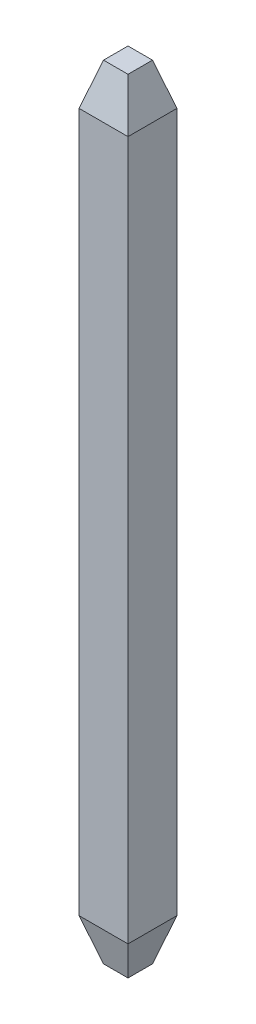
ISO-10303-21;
HEADER;
FILE_DESCRIPTION(('STEP AP214'),'2;1');
FILE_NAME('part.step','',(''),(''),'','','');
FILE_SCHEMA(('AUTOMOTIVE_DESIGN { 1 0 10303 214 1 1 1 1 }'));
ENDSEC;
DATA;
#1=APPLICATION_CONTEXT('core data for automotive mechanical design processes');
#2=APPLICATION_PROTOCOL_DEFINITION('international standard','automotive_design',2000,#1);
#3=PRODUCT_CONTEXT('',#1,'mechanical');
#4=PRODUCT('Part','Part','',(#3));
#5=PRODUCT_RELATED_PRODUCT_CATEGORY('part','',(#4));
#6=PRODUCT_DEFINITION_FORMATION('','',#4);
#7=PRODUCT_DEFINITION_CONTEXT('part definition',#1,'design');
#8=PRODUCT_DEFINITION('design','',#6,#7);
#9=PRODUCT_DEFINITION_SHAPE('','',#8);
#10=(LENGTH_UNIT() NAMED_UNIT(*) SI_UNIT(.MILLI.,.METRE.));
#11=(NAMED_UNIT(*) PLANE_ANGLE_UNIT() SI_UNIT($,.RADIAN.));
#12=(NAMED_UNIT(*) SI_UNIT($,.STERADIAN.) SOLID_ANGLE_UNIT());
#13=UNCERTAINTY_MEASURE_WITH_UNIT(LENGTH_MEASURE(1.E-05),#10,'distance_accuracy_value','');
#14=(GEOMETRIC_REPRESENTATION_CONTEXT(3) GLOBAL_UNCERTAINTY_ASSIGNED_CONTEXT((#13)) GLOBAL_UNIT_ASSIGNED_CONTEXT((#10,
#11,#12)) REPRESENTATION_CONTEXT('',''));
#15=CARTESIAN_POINT('',(0.,0.,0.));
#16=DIRECTION('',(0.,0.,1.));
#17=DIRECTION('',(1.,0.,0.));
#18=AXIS2_PLACEMENT_3D('',#15,#16,#17);
#19=CARTESIAN_POINT('',(13.8100000000129,-5.53543505344786,-16.6589999999763));
#20=DIRECTION('',(-1.,0.,0.));
#21=DIRECTION('',(0.,0.,1.));
#22=AXIS2_PLACEMENT_3D('',#19,#20,#21);
#23=PLANE('',#22);
#24=DIRECTION('',(0.,1.,0.));
#25=VECTOR('',#24,1.);
#26=CARTESIAN_POINT('',(13.8100000000129,-10.1039999999831,-17.2999999999763));
#27=LINE('',#26,#25);
#28=CARTESIAN_POINT('',(13.8100000000129,-10.1039999999831,-17.2999999999763));
#29=VERTEX_POINT('',#28);
#30=CARTESIAN_POINT('',(13.8100000000129,-0.965870106912631,-17.2999999999763));
#31=VERTEX_POINT('',#30);
#32=EDGE_CURVE('E137',#29,#31,#27,.T.);
#33=ORIENTED_EDGE('',*,*,#32,.F.);
#34=DIRECTION('',(0.,0.,-1.));
#35=VECTOR('',#34,1.);
#36=CARTESIAN_POINT('',(13.8100000000129,-10.1039999999831,-16.6599999999763));
#37=LINE('',#36,#35);
#38=CARTESIAN_POINT('',(13.8100000000129,-10.1039999999831,-16.6599999999763));
#39=VERTEX_POINT('',#38);
#40=EDGE_CURVE('E41',#39,#29,#37,.T.);
#41=ORIENTED_EDGE('',*,*,#40,.F.);
#42=DIRECTION('',(0.,1.,0.));
#43=VECTOR('',#42,1.);
#44=CARTESIAN_POINT('',(13.8100000000129,-10.1039999999831,-16.6599999999763));
#45=LINE('',#44,#43);
#46=CARTESIAN_POINT('',(13.8100000000129,-0.965870106912631,-16.6599999999763));
#47=VERTEX_POINT('',#46);
#48=EDGE_CURVE('E11',#39,#47,#45,.T.);
#49=ORIENTED_EDGE('',*,*,#48,.T.);
#50=DIRECTION('',(0.,0.,-1.));
#51=VECTOR('',#50,1.);
#52=CARTESIAN_POINT('',(13.8100000000129,-0.965870106912629,-16.6599999999763));
#53=LINE('',#52,#51);
#54=EDGE_CURVE('E28',#47,#31,#53,.T.);
#55=ORIENTED_EDGE('',*,*,#54,.T.);
#56=EDGE_LOOP('',(#33,#41,#49,#55));
#57=FACE_BOUND('',#56,.T.);
#58=ADVANCED_FACE('F17',(#57),#23,.T.);
#59=CARTESIAN_POINT('',(14.4510000000129,-5.53443505344787,-17.2999999999763));
#60=DIRECTION('',(0.,0.,-1.));
#61=DIRECTION('',(0.,-1.,0.));
#62=AXIS2_PLACEMENT_3D('',#59,#60,#61);
#63=PLANE('',#62);
#64=DIRECTION('',(0.,1.,0.));
#65=VECTOR('',#64,1.);
#66=CARTESIAN_POINT('',(14.4500000000129,-10.1039999999831,-17.2999999999763));
#67=LINE('',#66,#65);
#68=CARTESIAN_POINT('',(14.4500000000129,-10.1039999999831,-17.2999999999763));
#69=VERTEX_POINT('',#68);
#70=CARTESIAN_POINT('',(14.4500000000129,-0.965870106912631,-17.2999999999763));
#71=VERTEX_POINT('',#70);
#72=EDGE_CURVE('E143',#69,#71,#67,.T.);
#73=ORIENTED_EDGE('',*,*,#72,.F.);
#74=DIRECTION('',(1.,0.,0.));
#75=VECTOR('',#74,1.);
#76=CARTESIAN_POINT('',(13.8100000000129,-10.1039999999831,-17.2999999999763));
#77=LINE('',#76,#75);
#78=EDGE_CURVE('E161',#29,#69,#77,.T.);
#79=ORIENTED_EDGE('',*,*,#78,.F.);
#80=ORIENTED_EDGE('',*,*,#32,.T.);
#81=DIRECTION('',(1.,0.,0.));
#82=VECTOR('',#81,1.);
#83=CARTESIAN_POINT('',(13.8100000000129,-0.965870106912629,-17.2999999999763));
#84=LINE('',#83,#82);
#85=EDGE_CURVE('E139',#31,#71,#84,.T.);
#86=ORIENTED_EDGE('',*,*,#85,.T.);
#87=EDGE_LOOP('',(#73,#79,#80,#86));
#88=FACE_BOUND('',#87,.T.);
#89=ADVANCED_FACE('F321',(#88),#63,.T.);
#90=CARTESIAN_POINT('',(14.4500000000129,-11.0738701069126,-16.9799999999763));
#91=DIRECTION('',(1.,0.,0.));
#92=DIRECTION('',(0.,1.,0.));
#93=AXIS2_PLACEMENT_3D('',#90,#91,#92);
#94=PLANE('',#93);
#95=DIRECTION('',(0.,1.,0.));
#96=VECTOR('',#95,1.);
#97=CARTESIAN_POINT('',(14.4500000000129,-10.1039999999831,-16.6599999999763));
#98=LINE('',#97,#96);
#99=CARTESIAN_POINT('',(14.4500000000129,-10.1039999999831,-16.6599999999763));
#100=VERTEX_POINT('',#99);
#101=CARTESIAN_POINT('',(14.4500000000129,-0.965870106912631,-16.6599999999763));
#102=VERTEX_POINT('',#101);
#103=EDGE_CURVE('E157',#100,#102,#98,.T.);
#104=ORIENTED_EDGE('',*,*,#103,.F.);
#105=DIRECTION('',(0.,0.,1.));
#106=VECTOR('',#105,1.);
#107=CARTESIAN_POINT('',(14.4500000000129,-10.1039999999831,-17.2999999999763));
#108=LINE('',#107,#106);
#109=EDGE_CURVE('E166',#69,#100,#108,.T.);
#110=ORIENTED_EDGE('',*,*,#109,.F.);
#111=ORIENTED_EDGE('',*,*,#72,.T.);
#112=DIRECTION('',(0.,0.,1.));
#113=VECTOR('',#112,1.);
#114=CARTESIAN_POINT('',(14.4500000000129,-0.965870106912629,-17.2999999999763));
#115=LINE('',#114,#113);
#116=EDGE_CURVE('E147',#71,#102,#115,.T.);
#117=ORIENTED_EDGE('',*,*,#116,.T.);
#118=EDGE_LOOP('',(#104,#110,#111,#117));
#119=FACE_BOUND('',#118,.T.);
#120=ADVANCED_FACE('F312',(#119),#94,.T.);
#121=CARTESIAN_POINT('',(14.4500000000129,-0.965870106912629,-16.9799999999763));
#122=DIRECTION('',(0.95964490090097,0.281214622974639,0.));
#123=DIRECTION('',(0.,0.,-1.));
#124=AXIS2_PLACEMENT_3D('',#121,#122,#123);
#125=PLANE('',#124);
#126=DIRECTION('',(-0.270714017147724,0.923811583516618,0.270714017147727));
#127=VECTOR('',#126,1.);
#128=CARTESIAN_POINT('',(14.4500000000129,-0.965870106912629,-17.2999999999763));
#129=LINE('',#128,#127);
#130=CARTESIAN_POINT('',(14.2900000000129,-0.419870106912631,-17.1399999999763));
#131=VERTEX_POINT('',#130);
#132=EDGE_CURVE('E148',#71,#131,#129,.T.);
#133=ORIENTED_EDGE('',*,*,#132,.T.);
#134=DIRECTION('',(0.,0.,1.));
#135=VECTOR('',#134,1.);
#136=CARTESIAN_POINT('',(14.2900000000129,-0.419870106912629,-17.1399999999763));
#137=LINE('',#136,#135);
#138=CARTESIAN_POINT('',(14.2900000000129,-0.419870106912631,-16.8199999999763));
#139=VERTEX_POINT('',#138);
#140=EDGE_CURVE('E152',#131,#139,#137,.T.);
#141=ORIENTED_EDGE('',*,*,#140,.T.);
#142=DIRECTION('',(-0.270714017147724,0.923811583516618,-0.270714017147727));
#143=VECTOR('',#142,1.);
#144=CARTESIAN_POINT('',(14.4500000000129,-0.965870106912629,-16.6599999999763));
#145=LINE('',#144,#143);
#146=EDGE_CURVE('E165',#102,#139,#145,.T.);
#147=ORIENTED_EDGE('',*,*,#146,.F.);
#148=ORIENTED_EDGE('',*,*,#116,.F.);
#149=EDGE_LOOP('',(#133,#141,#147,#148));
#150=FACE_BOUND('',#149,.T.);
#151=ADVANCED_FACE('F309',(#150),#125,.T.);
#152=CARTESIAN_POINT('',(14.1300000000129,-0.965870106912629,-16.6599999999763));
#153=DIRECTION('',(0.,0.281214622974643,0.959644900900968));
#154=DIRECTION('',(1.,0.,0.));
#155=AXIS2_PLACEMENT_3D('',#152,#153,#154);
#156=PLANE('',#155);
#157=ORIENTED_EDGE('',*,*,#146,.T.);
#158=DIRECTION('',(-1.,0.,0.));
#159=VECTOR('',#158,1.);
#160=CARTESIAN_POINT('',(14.2900000000129,-0.419870106912629,-16.8199999999763));
#161=LINE('',#160,#159);
#162=CARTESIAN_POINT('',(13.9700000000129,-0.419870106912631,-16.8199999999763));
#163=VERTEX_POINT('',#162);
#164=EDGE_CURVE('E162',#139,#163,#161,.T.);
#165=ORIENTED_EDGE('',*,*,#164,.T.);
#166=DIRECTION('',(0.270714017147727,0.923811583516618,-0.270714017147727));
#167=VECTOR('',#166,1.);
#168=CARTESIAN_POINT('',(13.8100000000129,-0.965870106912629,-16.6599999999763));
#169=LINE('',#168,#167);
#170=EDGE_CURVE('E156',#47,#163,#169,.T.);
#171=ORIENTED_EDGE('',*,*,#170,.F.);
#172=DIRECTION('',(-1.,0.,0.));
#173=VECTOR('',#172,1.);
#174=CARTESIAN_POINT('',(14.4500000000129,-0.965870106912629,-16.6599999999763));
#175=LINE('',#174,#173);
#176=EDGE_CURVE('E174',#102,#47,#175,.T.);
#177=ORIENTED_EDGE('',*,*,#176,.F.);
#178=EDGE_LOOP('',(#157,#165,#171,#177));
#179=FACE_BOUND('',#178,.T.);
#180=ADVANCED_FACE('F314',(#179),#156,.T.);
#181=CARTESIAN_POINT('',(14.1300000000129,-0.419870106912629,-17.1409999999763));
#182=DIRECTION('',(0.,1.,0.));
#183=DIRECTION('',(1.,0.,0.));
#184=AXIS2_PLACEMENT_3D('',#181,#182,#183);
#185=PLANE('',#184);
#186=DIRECTION('',(1.,0.,0.));
#187=VECTOR('',#186,1.);
#188=CARTESIAN_POINT('',(13.9700000000129,-0.419870106912629,-17.1399999999763));
#189=LINE('',#188,#187);
#190=CARTESIAN_POINT('',(13.9700000000129,-0.419870106912631,-17.1399999999763));
#191=VERTEX_POINT('',#190);
#192=EDGE_CURVE('E133',#191,#131,#189,.T.);
#193=ORIENTED_EDGE('',*,*,#192,.F.);
#194=DIRECTION('',(0.,0.,-1.));
#195=VECTOR('',#194,1.);
#196=CARTESIAN_POINT('',(13.9700000000129,-0.419870106912629,-16.8199999999763));
#197=LINE('',#196,#195);
#198=EDGE_CURVE('E153',#163,#191,#197,.T.);
#199=ORIENTED_EDGE('',*,*,#198,.F.);
#200=ORIENTED_EDGE('',*,*,#164,.F.);
#201=ORIENTED_EDGE('',*,*,#140,.F.);
#202=EDGE_LOOP('',(#193,#199,#200,#201));
#203=FACE_BOUND('',#202,.T.);
#204=ADVANCED_FACE('F371',(#203),#185,.T.);
#205=CARTESIAN_POINT('',(14.4500000000129,-10.1039999999831,-16.9799999999763));
#206=DIRECTION('',(0.959644900900969,-0.281214622974641,0.));
#207=DIRECTION('',(0.,0.,-1.));
#208=AXIS2_PLACEMENT_3D('',#205,#206,#207);
#209=PLANE('',#208);
#210=ORIENTED_EDGE('',*,*,#109,.T.);
#211=DIRECTION('',(-0.270714017147724,-0.923811583516618,-0.270714017147728));
#212=VECTOR('',#211,1.);
#213=CARTESIAN_POINT('',(14.4500000000129,-10.1039999999831,-16.6599999999763));
#214=LINE('',#213,#212);
#215=CARTESIAN_POINT('',(14.2900000000129,-10.6499999999831,-16.8199999999763));
#216=VERTEX_POINT('',#215);
#217=EDGE_CURVE('E168',#100,#216,#214,.T.);
#218=ORIENTED_EDGE('',*,*,#217,.T.);
#219=DIRECTION('',(0.,0.,1.));
#220=VECTOR('',#219,1.);
#221=CARTESIAN_POINT('',(14.2900000000129,-10.6499999999831,-17.1399999999763));
#222=LINE('',#221,#220);
#223=CARTESIAN_POINT('',(14.2900000000129,-10.6499999999831,-17.1399999999763));
#224=VERTEX_POINT('',#223);
#225=EDGE_CURVE('E21',#224,#216,#222,.T.);
#226=ORIENTED_EDGE('',*,*,#225,.F.);
#227=DIRECTION('',(-0.270714017147724,-0.923811583516618,0.270714017147728));
#228=VECTOR('',#227,1.);
#229=CARTESIAN_POINT('',(14.4500000000129,-10.1039999999831,-17.2999999999763));
#230=LINE('',#229,#228);
#231=EDGE_CURVE('E190',#69,#224,#230,.T.);
#232=ORIENTED_EDGE('',*,*,#231,.F.);
#233=EDGE_LOOP('',(#210,#218,#226,#232));
#234=FACE_BOUND('',#233,.T.);
#235=ADVANCED_FACE('F195',(#234),#209,.T.);
#236=CARTESIAN_POINT('',(13.9690000000129,-10.6499999999831,-16.9799999999763));
#237=DIRECTION('',(0.,-1.,0.));
#238=DIRECTION('',(0.,0.,-1.));
#239=AXIS2_PLACEMENT_3D('',#236,#237,#238);
#240=PLANE('',#239);
#241=ORIENTED_EDGE('',*,*,#225,.T.);
#242=DIRECTION('',(-1.,0.,0.));
#243=VECTOR('',#242,1.);
#244=CARTESIAN_POINT('',(14.2900000000129,-10.6499999999831,-16.8199999999763));
#245=LINE('',#244,#243);
#246=CARTESIAN_POINT('',(13.9700000000129,-10.6499999999831,-16.8199999999763));
#247=VERTEX_POINT('',#246);
#248=EDGE_CURVE('E108',#216,#247,#245,.T.);
#249=ORIENTED_EDGE('',*,*,#248,.T.);
#250=DIRECTION('',(0.,0.,-1.));
#251=VECTOR('',#250,1.);
#252=CARTESIAN_POINT('',(13.9700000000129,-10.6499999999831,-16.8199999999763));
#253=LINE('',#252,#251);
#254=CARTESIAN_POINT('',(13.9700000000129,-10.6499999999831,-17.1399999999763));
#255=VERTEX_POINT('',#254);
#256=EDGE_CURVE('E98',#247,#255,#253,.T.);
#257=ORIENTED_EDGE('',*,*,#256,.T.);
#258=DIRECTION('',(1.,0.,0.));
#259=VECTOR('',#258,1.);
#260=CARTESIAN_POINT('',(13.9700000000129,-10.6499999999831,-17.1399999999763));
#261=LINE('',#260,#259);
#262=EDGE_CURVE('E109',#255,#224,#261,.T.);
#263=ORIENTED_EDGE('',*,*,#262,.T.);
#264=EDGE_LOOP('',(#241,#249,#257,#263));
#265=FACE_BOUND('',#264,.T.);
#266=ADVANCED_FACE('F112',(#265),#240,.T.);
#267=CARTESIAN_POINT('',(14.1300000000129,-10.1039999999831,-16.6599999999763));
#268=DIRECTION('',(0.,-0.281214622974644,0.959644900900968));
#269=DIRECTION('',(-1.,0.,0.));
#270=AXIS2_PLACEMENT_3D('',#267,#268,#269);
#271=PLANE('',#270);
#272=DIRECTION('',(-1.,0.,0.));
#273=VECTOR('',#272,1.);
#274=CARTESIAN_POINT('',(14.4500000000129,-10.1039999999831,-16.6599999999763));
#275=LINE('',#274,#273);
#276=EDGE_CURVE('E121',#100,#39,#275,.T.);
#277=ORIENTED_EDGE('',*,*,#276,.T.);
#278=DIRECTION('',(0.270714017147728,-0.923811583516617,-0.270714017147728));
#279=VECTOR('',#278,1.);
#280=CARTESIAN_POINT('',(13.8100000000129,-10.1039999999831,-16.6599999999763));
#281=LINE('',#280,#279);
#282=EDGE_CURVE('E102',#39,#247,#281,.T.);
#283=ORIENTED_EDGE('',*,*,#282,.T.);
#284=ORIENTED_EDGE('',*,*,#248,.F.);
#285=ORIENTED_EDGE('',*,*,#217,.F.);
#286=EDGE_LOOP('',(#277,#283,#284,#285));
#287=FACE_BOUND('',#286,.T.);
#288=ADVANCED_FACE('F19',(#287),#271,.T.);
#289=CARTESIAN_POINT('',(14.1300000000129,-0.965870106912629,-17.2999999999763));
#290=DIRECTION('',(0.,0.281214622974643,-0.959644900900968));
#291=DIRECTION('',(-1.,0.,0.));
#292=AXIS2_PLACEMENT_3D('',#289,#290,#291);
#293=PLANE('',#292);
#294=DIRECTION('',(0.270714017147727,0.923811583516618,0.270714017147727));
#295=VECTOR('',#294,1.);
#296=CARTESIAN_POINT('',(13.8100000000129,-0.965870106912629,-17.2999999999763));
#297=LINE('',#296,#295);
#298=EDGE_CURVE('E124',#31,#191,#297,.T.);
#299=ORIENTED_EDGE('',*,*,#298,.T.);
#300=ORIENTED_EDGE('',*,*,#192,.T.);
#301=ORIENTED_EDGE('',*,*,#132,.F.);
#302=ORIENTED_EDGE('',*,*,#85,.F.);
#303=EDGE_LOOP('',(#299,#300,#301,#302));
#304=FACE_BOUND('',#303,.T.);
#305=ADVANCED_FACE('F368',(#304),#293,.T.);
#306=CARTESIAN_POINT('',(14.1300000000129,-10.1039999999831,-17.2999999999763));
#307=DIRECTION('',(0.,-0.281214622974644,-0.959644900900968));
#308=DIRECTION('',(0.,-0.959644900900968,0.281214622974644));
#309=AXIS2_PLACEMENT_3D('',#306,#307,#308);
#310=PLANE('',#309);
#311=ORIENTED_EDGE('',*,*,#78,.T.);
#312=ORIENTED_EDGE('',*,*,#231,.T.);
#313=ORIENTED_EDGE('',*,*,#262,.F.);
#314=DIRECTION('',(0.270714017147728,-0.923811583516617,0.270714017147728));
#315=VECTOR('',#314,1.);
#316=CARTESIAN_POINT('',(13.8100000000129,-10.1039999999831,-17.2999999999763));
#317=LINE('',#316,#315);
#318=EDGE_CURVE('E104',#29,#255,#317,.T.);
#319=ORIENTED_EDGE('',*,*,#318,.F.);
#320=EDGE_LOOP('',(#311,#312,#313,#319));
#321=FACE_BOUND('',#320,.T.);
#322=ADVANCED_FACE('F188',(#321),#310,.T.);
#323=CARTESIAN_POINT('',(13.8100000000129,-0.965870106912629,-16.9799999999763));
#324=DIRECTION('',(-0.959644900900968,0.281214622974643,0.));
#325=DIRECTION('',(0.,0.,1.));
#326=AXIS2_PLACEMENT_3D('',#323,#324,#325);
#327=PLANE('',#326);
#328=ORIENTED_EDGE('',*,*,#170,.T.);
#329=ORIENTED_EDGE('',*,*,#198,.T.);
#330=ORIENTED_EDGE('',*,*,#298,.F.);
#331=ORIENTED_EDGE('',*,*,#54,.F.);
#332=EDGE_LOOP('',(#328,#329,#330,#331));
#333=FACE_BOUND('',#332,.T.);
#334=ADVANCED_FACE('F317',(#333),#327,.T.);
#335=CARTESIAN_POINT('',(13.8090000000129,-5.53543505344787,-16.6599999999763));
#336=DIRECTION('',(0.,0.,1.));
#337=DIRECTION('',(1.,0.,0.));
#338=AXIS2_PLACEMENT_3D('',#335,#336,#337);
#339=PLANE('',#338);
#340=ORIENTED_EDGE('',*,*,#48,.F.);
#341=ORIENTED_EDGE('',*,*,#276,.F.);
#342=ORIENTED_EDGE('',*,*,#103,.T.);
#343=ORIENTED_EDGE('',*,*,#176,.T.);
#344=EDGE_LOOP('',(#340,#341,#342,#343));
#345=FACE_BOUND('',#344,.T.);
#346=ADVANCED_FACE('F305',(#345),#339,.T.);
#347=CARTESIAN_POINT('',(13.8100000000129,-10.1039999999831,-16.9799999999763));
#348=DIRECTION('',(-0.959644900900968,-0.281214622974644,0.));
#349=DIRECTION('',(-0.281214622974644,0.959644900900968,0.));
#350=AXIS2_PLACEMENT_3D('',#347,#348,#349);
#351=PLANE('',#350);
#352=ORIENTED_EDGE('',*,*,#40,.T.);
#353=ORIENTED_EDGE('',*,*,#318,.T.);
#354=ORIENTED_EDGE('',*,*,#256,.F.);
#355=ORIENTED_EDGE('',*,*,#282,.F.);
#356=EDGE_LOOP('',(#352,#353,#354,#355));
#357=FACE_BOUND('',#356,.T.);
#358=ADVANCED_FACE('F100',(#357),#351,.T.);
#359=CLOSED_SHELL('',(#58,#89,#120,#151,#180,#204,#235,#266,#288,#305,#322,#334,#346,#358));
#360=MANIFOLD_SOLID_BREP('B1',#359);
#361=ADVANCED_BREP_SHAPE_REPRESENTATION('',(#18,#360),#14);
#362=SHAPE_DEFINITION_REPRESENTATION(#9,#361);
ENDSEC;
END-ISO-10303-21;
